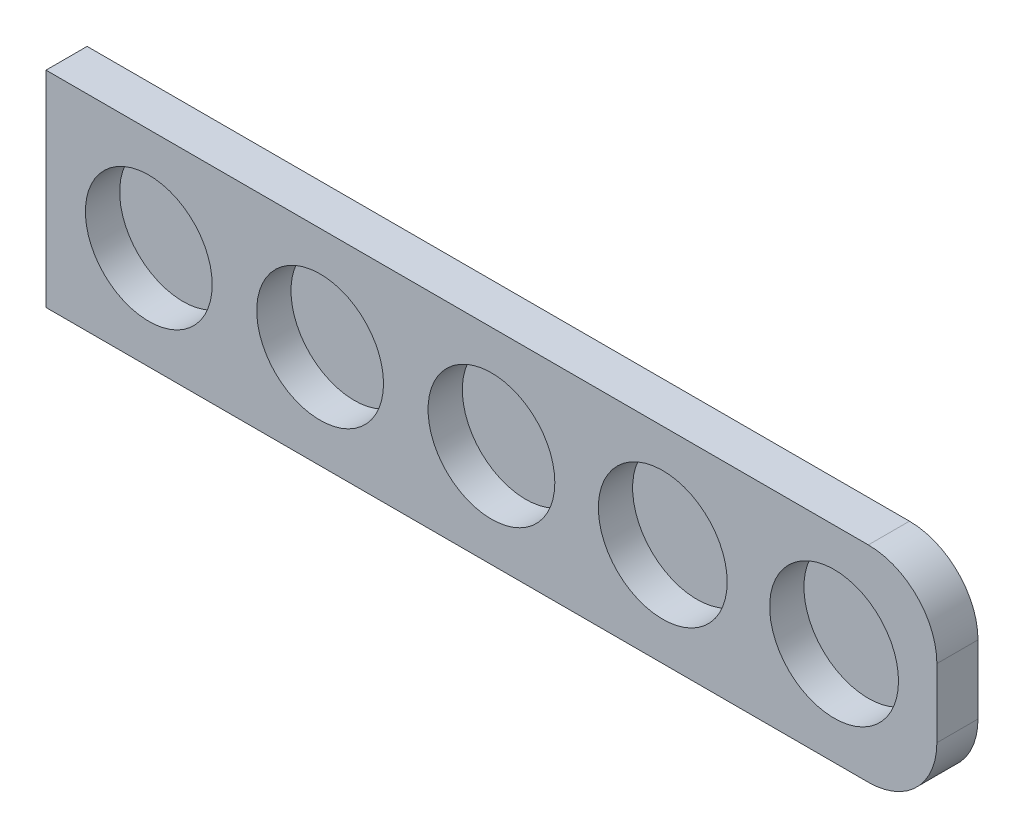
ISO-10303-21;
HEADER;
FILE_DESCRIPTION(('STEP AP214'),'2;1');
FILE_NAME('part.step','',(''),(''),'','','');
FILE_SCHEMA(('AUTOMOTIVE_DESIGN { 1 0 10303 214 1 1 1 1 }'));
ENDSEC;
DATA;
#1=APPLICATION_CONTEXT('core data for automotive mechanical design processes');
#2=APPLICATION_PROTOCOL_DEFINITION('international standard','automotive_design',2000,#1);
#3=PRODUCT_CONTEXT('',#1,'mechanical');
#4=PRODUCT('Part','Part','',(#3));
#5=PRODUCT_RELATED_PRODUCT_CATEGORY('part','',(#4));
#6=PRODUCT_DEFINITION_FORMATION('','',#4);
#7=PRODUCT_DEFINITION_CONTEXT('part definition',#1,'design');
#8=PRODUCT_DEFINITION('design','',#6,#7);
#9=PRODUCT_DEFINITION_SHAPE('','',#8);
#10=(LENGTH_UNIT() NAMED_UNIT(*) SI_UNIT(.MILLI.,.METRE.));
#11=(NAMED_UNIT(*) PLANE_ANGLE_UNIT() SI_UNIT($,.RADIAN.));
#12=(NAMED_UNIT(*) SI_UNIT($,.STERADIAN.) SOLID_ANGLE_UNIT());
#13=UNCERTAINTY_MEASURE_WITH_UNIT(LENGTH_MEASURE(1.E-05),#10,'distance_accuracy_value','');
#14=(GEOMETRIC_REPRESENTATION_CONTEXT(3) GLOBAL_UNCERTAINTY_ASSIGNED_CONTEXT((#13)) GLOBAL_UNIT_ASSIGNED_CONTEXT((#10,
#11,#12)) REPRESENTATION_CONTEXT('',''));
#15=CARTESIAN_POINT('',(0.,0.,0.));
#16=DIRECTION('',(0.,0.,1.));
#17=DIRECTION('',(1.,0.,0.));
#18=AXIS2_PLACEMENT_3D('',#15,#16,#17);
#19=CARTESIAN_POINT('',(0.,-56.,6.));
#20=DIRECTION('',(0.,1.,0.));
#21=DIRECTION('',(0.,0.,1.));
#22=AXIS2_PLACEMENT_3D('',#19,#20,#21);
#23=PLANE('',#22);
#24=DIRECTION('',(1.,0.,0.));
#25=VECTOR('',#24,1.);
#26=CARTESIAN_POINT('',(0.,-56.,6.));
#27=LINE('',#26,#25);
#28=CARTESIAN_POINT('',(0.,-56.,6.));
#29=VERTEX_POINT('',#28);
#30=CARTESIAN_POINT('',(120.,-56.,6.));
#31=VERTEX_POINT('',#30);
#32=EDGE_CURVE('E103',#29,#31,#27,.T.);
#33=ORIENTED_EDGE('',*,*,#32,.T.);
#34=DIRECTION('',(0.,0.,-1.));
#35=VECTOR('',#34,1.);
#36=CARTESIAN_POINT('',(120.,-56.,6.));
#37=LINE('',#36,#35);
#38=CARTESIAN_POINT('',(120.,-56.,0.));
#39=VERTEX_POINT('',#38);
#40=EDGE_CURVE('E117',#31,#39,#37,.T.);
#41=ORIENTED_EDGE('',*,*,#40,.T.);
#42=DIRECTION('',(1.,0.,0.));
#43=VECTOR('',#42,1.);
#44=CARTESIAN_POINT('',(0.,-56.,0.));
#45=LINE('',#44,#43);
#46=CARTESIAN_POINT('',(0.,-56.,0.));
#47=VERTEX_POINT('',#46);
#48=EDGE_CURVE('E107',#47,#39,#45,.T.);
#49=ORIENTED_EDGE('',*,*,#48,.F.);
#50=DIRECTION('',(0.,0.,-1.));
#51=VECTOR('',#50,1.);
#52=CARTESIAN_POINT('',(0.,-56.,6.));
#53=LINE('',#52,#51);
#54=EDGE_CURVE('E98',#29,#47,#53,.T.);
#55=ORIENTED_EDGE('',*,*,#54,.F.);
#56=EDGE_LOOP('',(#33,#41,#49,#55));
#57=FACE_BOUND('',#56,.T.);
#58=ADVANCED_FACE('F33',(#57),#23,.T.);
#59=CARTESIAN_POINT('',(0.,-86.,6.));
#60=DIRECTION('',(-1.,0.,0.));
#61=DIRECTION('',(0.,-1.,0.));
#62=AXIS2_PLACEMENT_3D('',#59,#60,#61);
#63=PLANE('',#62);
#64=DIRECTION('',(0.,1.,0.));
#65=VECTOR('',#64,1.);
#66=CARTESIAN_POINT('',(0.,-86.,0.));
#67=LINE('',#66,#65);
#68=CARTESIAN_POINT('',(0.,-86.,0.));
#69=VERTEX_POINT('',#68);
#70=EDGE_CURVE('E97',#69,#47,#67,.T.);
#71=ORIENTED_EDGE('',*,*,#70,.F.);
#72=DIRECTION('',(0.,0.,-1.));
#73=VECTOR('',#72,1.);
#74=CARTESIAN_POINT('',(0.,-86.,6.));
#75=LINE('',#74,#73);
#76=CARTESIAN_POINT('',(0.,-86.,6.));
#77=VERTEX_POINT('',#76);
#78=EDGE_CURVE('E87',#77,#69,#75,.T.);
#79=ORIENTED_EDGE('',*,*,#78,.F.);
#80=DIRECTION('',(0.,1.,0.));
#81=VECTOR('',#80,1.);
#82=CARTESIAN_POINT('',(0.,-86.,6.));
#83=LINE('',#82,#81);
#84=EDGE_CURVE('E90',#77,#29,#83,.T.);
#85=ORIENTED_EDGE('',*,*,#84,.T.);
#86=ORIENTED_EDGE('',*,*,#54,.T.);
#87=EDGE_LOOP('',(#71,#79,#85,#86));
#88=FACE_BOUND('',#87,.T.);
#89=ADVANCED_FACE('F95',(#88),#63,.T.);
#90=CARTESIAN_POINT('',(130.,-86.,6.));
#91=DIRECTION('',(0.,-1.,0.));
#92=DIRECTION('',(0.,0.,-1.));
#93=AXIS2_PLACEMENT_3D('',#90,#91,#92);
#94=PLANE('',#93);
#95=DIRECTION('',(-1.,0.,0.));
#96=VECTOR('',#95,1.);
#97=CARTESIAN_POINT('',(130.,-86.,0.));
#98=LINE('',#97,#96);
#99=CARTESIAN_POINT('',(120.,-86.,0.));
#100=VERTEX_POINT('',#99);
#101=EDGE_CURVE('E114',#100,#69,#98,.T.);
#102=ORIENTED_EDGE('',*,*,#101,.F.);
#103=DIRECTION('',(0.,0.,-1.));
#104=VECTOR('',#103,1.);
#105=CARTESIAN_POINT('',(120.,-86.,6.));
#106=LINE('',#105,#104);
#107=CARTESIAN_POINT('',(120.,-86.,6.));
#108=VERTEX_POINT('',#107);
#109=EDGE_CURVE('E11',#100,#108,#106,.F.);
#110=ORIENTED_EDGE('',*,*,#109,.T.);
#111=DIRECTION('',(-1.,0.,0.));
#112=VECTOR('',#111,1.);
#113=CARTESIAN_POINT('',(130.,-86.,6.));
#114=LINE('',#113,#112);
#115=EDGE_CURVE('E84',#108,#77,#114,.T.);
#116=ORIENTED_EDGE('',*,*,#115,.T.);
#117=ORIENTED_EDGE('',*,*,#78,.T.);
#118=EDGE_LOOP('',(#102,#110,#116,#117));
#119=FACE_BOUND('',#118,.T.);
#120=ADVANCED_FACE('F86',(#119),#94,.T.);
#121=CARTESIAN_POINT('',(130.,-56.,6.));
#122=DIRECTION('',(1.,0.,0.));
#123=DIRECTION('',(0.,0.,-1.));
#124=AXIS2_PLACEMENT_3D('',#121,#122,#123);
#125=PLANE('',#124);
#126=DIRECTION('',(0.,-1.,0.));
#127=VECTOR('',#126,1.);
#128=CARTESIAN_POINT('',(130.,-56.,0.));
#129=LINE('',#128,#127);
#130=CARTESIAN_POINT('',(130.,-66.,0.));
#131=VERTEX_POINT('',#130);
#132=CARTESIAN_POINT('',(130.,-76.,0.));
#133=VERTEX_POINT('',#132);
#134=EDGE_CURVE('E110',#131,#133,#129,.T.);
#135=ORIENTED_EDGE('',*,*,#134,.F.);
#136=DIRECTION('',(0.,0.,-1.));
#137=VECTOR('',#136,1.);
#138=CARTESIAN_POINT('',(130.,-66.,6.));
#139=LINE('',#138,#137);
#140=CARTESIAN_POINT('',(130.,-66.,6.));
#141=VERTEX_POINT('',#140);
#142=EDGE_CURVE('E128',#131,#141,#139,.F.);
#143=ORIENTED_EDGE('',*,*,#142,.T.);
#144=DIRECTION('',(0.,-1.,0.));
#145=VECTOR('',#144,1.);
#146=CARTESIAN_POINT('',(130.,-56.,6.));
#147=LINE('',#146,#145);
#148=CARTESIAN_POINT('',(130.,-76.,6.));
#149=VERTEX_POINT('',#148);
#150=EDGE_CURVE('E91',#141,#149,#147,.T.);
#151=ORIENTED_EDGE('',*,*,#150,.T.);
#152=DIRECTION('',(0.,0.,-1.));
#153=VECTOR('',#152,1.);
#154=CARTESIAN_POINT('',(130.,-76.,6.));
#155=LINE('',#154,#153);
#156=EDGE_CURVE('E125',#149,#133,#155,.T.);
#157=ORIENTED_EDGE('',*,*,#156,.T.);
#158=EDGE_LOOP('',(#135,#143,#151,#157));
#159=FACE_BOUND('',#158,.T.);
#160=ADVANCED_FACE('F142',(#159),#125,.T.);
#161=CARTESIAN_POINT('',(0.,0.,6.));
#162=DIRECTION('',(0.,0.,-1.));
#163=DIRECTION('',(-1.,0.,0.));
#164=AXIS2_PLACEMENT_3D('',#161,#162,#163);
#165=PLANE('',#164);
#166=CARTESIAN_POINT('',(15.,-71.,6.));
#167=DIRECTION('',(0.,0.,1.));
#168=DIRECTION('',(1.,0.,0.));
#169=AXIS2_PLACEMENT_3D('',#166,#167,#168);
#170=CIRCLE('',#169,9.24999999999999);
#171=CARTESIAN_POINT('',(24.25,-71.,6.));
#172=VERTEX_POINT('',#171);
#173=EDGE_CURVE('E212',#172,#172,#170,.T.);
#174=ORIENTED_EDGE('',*,*,#173,.F.);
#175=EDGE_LOOP('',(#174));
#176=FACE_BOUND('',#175,.T.);
#177=CARTESIAN_POINT('',(40.,-71.,6.));
#178=DIRECTION('',(0.,0.,1.));
#179=DIRECTION('',(1.,0.,0.));
#180=AXIS2_PLACEMENT_3D('',#177,#178,#179);
#181=CIRCLE('',#180,9.24999999999999);
#182=CARTESIAN_POINT('',(49.25,-71.,6.));
#183=VERTEX_POINT('',#182);
#184=EDGE_CURVE('E214',#183,#183,#181,.T.);
#185=ORIENTED_EDGE('',*,*,#184,.F.);
#186=EDGE_LOOP('',(#185));
#187=FACE_BOUND('',#186,.T.);
#188=CARTESIAN_POINT('',(65.,-71.,6.));
#189=DIRECTION('',(0.,0.,1.));
#190=DIRECTION('',(1.,0.,0.));
#191=AXIS2_PLACEMENT_3D('',#188,#189,#190);
#192=CIRCLE('',#191,9.24999999999999);
#193=CARTESIAN_POINT('',(74.25,-71.,6.));
#194=VERTEX_POINT('',#193);
#195=EDGE_CURVE('E222',#194,#194,#192,.T.);
#196=ORIENTED_EDGE('',*,*,#195,.F.);
#197=EDGE_LOOP('',(#196));
#198=FACE_BOUND('',#197,.T.);
#199=CARTESIAN_POINT('',(90.,-71.,6.));
#200=DIRECTION('',(0.,0.,1.));
#201=DIRECTION('',(1.,0.,0.));
#202=AXIS2_PLACEMENT_3D('',#199,#200,#201);
#203=CIRCLE('',#202,9.39999999999999);
#204=CARTESIAN_POINT('',(99.4,-71.,6.));
#205=VERTEX_POINT('',#204);
#206=EDGE_CURVE('E228',#205,#205,#203,.T.);
#207=ORIENTED_EDGE('',*,*,#206,.F.);
#208=EDGE_LOOP('',(#207));
#209=FACE_BOUND('',#208,.T.);
#210=CARTESIAN_POINT('',(115.,-71.,6.));
#211=DIRECTION('',(0.,0.,1.));
#212=DIRECTION('',(1.,0.,0.));
#213=AXIS2_PLACEMENT_3D('',#210,#211,#212);
#214=CIRCLE('',#213,9.39999999999999);
#215=CARTESIAN_POINT('',(124.4,-71.,6.));
#216=VERTEX_POINT('',#215);
#217=EDGE_CURVE('E234',#216,#216,#214,.T.);
#218=ORIENTED_EDGE('',*,*,#217,.F.);
#219=EDGE_LOOP('',(#218));
#220=FACE_BOUND('',#219,.T.);
#221=ORIENTED_EDGE('',*,*,#150,.F.);
#222=CARTESIAN_POINT('',(120.,-66.,6.));
#223=DIRECTION('',(0.,0.,-1.));
#224=DIRECTION('',(-1.,0.,0.));
#225=AXIS2_PLACEMENT_3D('',#222,#223,#224);
#226=CIRCLE('',#225,10.);
#227=EDGE_CURVE('E41',#141,#31,#226,.F.);
#228=ORIENTED_EDGE('',*,*,#227,.T.);
#229=ORIENTED_EDGE('',*,*,#32,.F.);
#230=ORIENTED_EDGE('',*,*,#84,.F.);
#231=ORIENTED_EDGE('',*,*,#115,.F.);
#232=CARTESIAN_POINT('',(120.,-76.,6.));
#233=DIRECTION('',(0.,0.,-1.));
#234=DIRECTION('',(-1.,0.,0.));
#235=AXIS2_PLACEMENT_3D('',#232,#233,#234);
#236=CIRCLE('',#235,10.);
#237=EDGE_CURVE('E53',#108,#149,#236,.F.);
#238=ORIENTED_EDGE('',*,*,#237,.T.);
#239=EDGE_LOOP('',(#221,#228,#229,#230,#231,#238));
#240=FACE_BOUND('',#239,.T.);
#241=ADVANCED_FACE('F101',(#176,#187,#198,#209,#220,#240),#165,.F.);
#242=CARTESIAN_POINT('',(0.,0.,0.));
#243=DIRECTION('',(0.,0.,-1.));
#244=DIRECTION('',(-1.,0.,0.));
#245=AXIS2_PLACEMENT_3D('',#242,#243,#244);
#246=PLANE('',#245);
#247=ORIENTED_EDGE('',*,*,#48,.T.);
#248=CARTESIAN_POINT('',(120.,-66.,0.));
#249=DIRECTION('',(0.,0.,-1.));
#250=DIRECTION('',(-1.,0.,0.));
#251=AXIS2_PLACEMENT_3D('',#248,#249,#250);
#252=CIRCLE('',#251,10.);
#253=EDGE_CURVE('E123',#39,#131,#252,.T.);
#254=ORIENTED_EDGE('',*,*,#253,.T.);
#255=ORIENTED_EDGE('',*,*,#134,.T.);
#256=CARTESIAN_POINT('',(120.,-76.,0.));
#257=DIRECTION('',(0.,0.,-1.));
#258=DIRECTION('',(-1.,0.,0.));
#259=AXIS2_PLACEMENT_3D('',#256,#257,#258);
#260=CIRCLE('',#259,10.);
#261=EDGE_CURVE('E121',#133,#100,#260,.T.);
#262=ORIENTED_EDGE('',*,*,#261,.T.);
#263=ORIENTED_EDGE('',*,*,#101,.T.);
#264=ORIENTED_EDGE('',*,*,#70,.T.);
#265=EDGE_LOOP('',(#247,#254,#255,#262,#263,#264));
#266=FACE_BOUND('',#265,.T.);
#267=ADVANCED_FACE('F140',(#266),#246,.T.);
#268=CARTESIAN_POINT('',(115.,-71.,1.00000000000001));
#269=DIRECTION('',(0.,0.,-1.));
#270=DIRECTION('',(-1.,0.,0.));
#271=AXIS2_PLACEMENT_3D('',#268,#269,#270);
#272=PLANE('',#271);
#273=CARTESIAN_POINT('',(115.,-71.,0.999999999999995));
#274=DIRECTION('',(0.,0.,1.));
#275=DIRECTION('',(1.,0.,0.));
#276=AXIS2_PLACEMENT_3D('',#273,#274,#275);
#277=CIRCLE('',#276,9.39999999999999);
#278=CARTESIAN_POINT('',(124.4,-71.,0.999999999999995));
#279=VERTEX_POINT('',#278);
#280=EDGE_CURVE('E111',#279,#279,#277,.T.);
#281=ORIENTED_EDGE('',*,*,#280,.T.);
#282=EDGE_LOOP('',(#281));
#283=FACE_BOUND('',#282,.T.);
#284=ADVANCED_FACE('F163',(#283),#272,.F.);
#285=CARTESIAN_POINT('',(115.,-71.,6.));
#286=DIRECTION('',(0.,0.,1.));
#287=DIRECTION('',(1.,0.,0.));
#288=AXIS2_PLACEMENT_3D('',#285,#286,#287);
#289=CYLINDRICAL_SURFACE('',#288,9.39999999999999);
#290=ORIENTED_EDGE('',*,*,#280,.F.);
#291=EDGE_LOOP('',(#290));
#292=FACE_BOUND('',#291,.T.);
#293=ORIENTED_EDGE('',*,*,#217,.T.);
#294=EDGE_LOOP('',(#293));
#295=FACE_BOUND('',#294,.T.);
#296=ADVANCED_FACE('F169',(#292,#295),#289,.F.);
#297=CARTESIAN_POINT('',(90.,-71.,1.00000000000001));
#298=DIRECTION('',(0.,0.,-1.));
#299=DIRECTION('',(-1.,0.,0.));
#300=AXIS2_PLACEMENT_3D('',#297,#298,#299);
#301=PLANE('',#300);
#302=CARTESIAN_POINT('',(90.,-71.,0.999999999999995));
#303=DIRECTION('',(0.,0.,1.));
#304=DIRECTION('',(1.,0.,0.));
#305=AXIS2_PLACEMENT_3D('',#302,#303,#304);
#306=CIRCLE('',#305,9.39999999999999);
#307=CARTESIAN_POINT('',(99.4,-71.,0.999999999999995));
#308=VERTEX_POINT('',#307);
#309=EDGE_CURVE('E231',#308,#308,#306,.T.);
#310=ORIENTED_EDGE('',*,*,#309,.T.);
#311=EDGE_LOOP('',(#310));
#312=FACE_BOUND('',#311,.T.);
#313=ADVANCED_FACE('F173',(#312),#301,.F.);
#314=CARTESIAN_POINT('',(90.,-71.,6.));
#315=DIRECTION('',(0.,0.,1.));
#316=DIRECTION('',(1.,0.,0.));
#317=AXIS2_PLACEMENT_3D('',#314,#315,#316);
#318=CYLINDRICAL_SURFACE('',#317,9.39999999999999);
#319=ORIENTED_EDGE('',*,*,#309,.F.);
#320=EDGE_LOOP('',(#319));
#321=FACE_BOUND('',#320,.T.);
#322=ORIENTED_EDGE('',*,*,#206,.T.);
#323=EDGE_LOOP('',(#322));
#324=FACE_BOUND('',#323,.T.);
#325=ADVANCED_FACE('F177',(#321,#324),#318,.F.);
#326=CARTESIAN_POINT('',(65.,-71.,1.00000000000001));
#327=DIRECTION('',(0.,0.,-1.));
#328=DIRECTION('',(-1.,0.,0.));
#329=AXIS2_PLACEMENT_3D('',#326,#327,#328);
#330=PLANE('',#329);
#331=CARTESIAN_POINT('',(65.,-71.,0.999999999999995));
#332=DIRECTION('',(0.,0.,1.));
#333=DIRECTION('',(1.,0.,0.));
#334=AXIS2_PLACEMENT_3D('',#331,#332,#333);
#335=CIRCLE('',#334,9.24999999999998);
#336=CARTESIAN_POINT('',(74.25,-71.,0.999999999999995));
#337=VERTEX_POINT('',#336);
#338=EDGE_CURVE('E225',#337,#337,#335,.T.);
#339=ORIENTED_EDGE('',*,*,#338,.T.);
#340=EDGE_LOOP('',(#339));
#341=FACE_BOUND('',#340,.T.);
#342=ADVANCED_FACE('F181',(#341),#330,.F.);
#343=CARTESIAN_POINT('',(65.,-71.,6.));
#344=DIRECTION('',(0.,0.,1.));
#345=DIRECTION('',(1.,0.,0.));
#346=AXIS2_PLACEMENT_3D('',#343,#344,#345);
#347=CYLINDRICAL_SURFACE('',#346,9.24999999999999);
#348=ORIENTED_EDGE('',*,*,#338,.F.);
#349=EDGE_LOOP('',(#348));
#350=FACE_BOUND('',#349,.T.);
#351=ORIENTED_EDGE('',*,*,#195,.T.);
#352=EDGE_LOOP('',(#351));
#353=FACE_BOUND('',#352,.T.);
#354=ADVANCED_FACE('F185',(#350,#353),#347,.F.);
#355=CARTESIAN_POINT('',(40.,-71.,1.00000000000001));
#356=DIRECTION('',(0.,0.,-1.));
#357=DIRECTION('',(-1.,0.,0.));
#358=AXIS2_PLACEMENT_3D('',#355,#356,#357);
#359=PLANE('',#358);
#360=CARTESIAN_POINT('',(40.,-71.,0.999999999999995));
#361=DIRECTION('',(0.,0.,1.));
#362=DIRECTION('',(1.,0.,0.));
#363=AXIS2_PLACEMENT_3D('',#360,#361,#362);
#364=CIRCLE('',#363,9.24999999999999);
#365=CARTESIAN_POINT('',(49.25,-71.,0.999999999999995));
#366=VERTEX_POINT('',#365);
#367=EDGE_CURVE('E219',#366,#366,#364,.T.);
#368=ORIENTED_EDGE('',*,*,#367,.T.);
#369=EDGE_LOOP('',(#368));
#370=FACE_BOUND('',#369,.T.);
#371=ADVANCED_FACE('F189',(#370),#359,.F.);
#372=CARTESIAN_POINT('',(40.,-71.,6.));
#373=DIRECTION('',(0.,0.,1.));
#374=DIRECTION('',(1.,0.,0.));
#375=AXIS2_PLACEMENT_3D('',#372,#373,#374);
#376=CYLINDRICAL_SURFACE('',#375,9.24999999999999);
#377=ORIENTED_EDGE('',*,*,#367,.F.);
#378=EDGE_LOOP('',(#377));
#379=FACE_BOUND('',#378,.T.);
#380=ORIENTED_EDGE('',*,*,#184,.T.);
#381=EDGE_LOOP('',(#380));
#382=FACE_BOUND('',#381,.T.);
#383=ADVANCED_FACE('F193',(#379,#382),#376,.F.);
#384=CARTESIAN_POINT('',(15.,-71.,1.00000000000001));
#385=DIRECTION('',(0.,0.,-1.));
#386=DIRECTION('',(-1.,0.,0.));
#387=AXIS2_PLACEMENT_3D('',#384,#385,#386);
#388=PLANE('',#387);
#389=CARTESIAN_POINT('',(15.,-71.,0.999999999999995));
#390=DIRECTION('',(0.,0.,1.));
#391=DIRECTION('',(1.,0.,0.));
#392=AXIS2_PLACEMENT_3D('',#389,#390,#391);
#393=CIRCLE('',#392,9.24999999999999);
#394=CARTESIAN_POINT('',(24.25,-71.,0.999999999999995));
#395=VERTEX_POINT('',#394);
#396=EDGE_CURVE('E209',#395,#395,#393,.T.);
#397=ORIENTED_EDGE('',*,*,#396,.T.);
#398=EDGE_LOOP('',(#397));
#399=FACE_BOUND('',#398,.T.);
#400=ADVANCED_FACE('F197',(#399),#388,.F.);
#401=CARTESIAN_POINT('',(15.,-71.,6.));
#402=DIRECTION('',(0.,0.,1.));
#403=DIRECTION('',(1.,0.,0.));
#404=AXIS2_PLACEMENT_3D('',#401,#402,#403);
#405=CYLINDRICAL_SURFACE('',#404,9.24999999999999);
#406=ORIENTED_EDGE('',*,*,#396,.F.);
#407=EDGE_LOOP('',(#406));
#408=FACE_BOUND('',#407,.T.);
#409=ORIENTED_EDGE('',*,*,#173,.T.);
#410=EDGE_LOOP('',(#409));
#411=FACE_BOUND('',#410,.T.);
#412=ADVANCED_FACE('F149',(#408,#411),#405,.F.);
#413=CARTESIAN_POINT('',(120.,-66.,6.));
#414=DIRECTION('',(0.,0.,-1.));
#415=DIRECTION('',(-1.,0.,0.));
#416=AXIS2_PLACEMENT_3D('',#413,#414,#415);
#417=CYLINDRICAL_SURFACE('',#416,10.);
#418=ORIENTED_EDGE('',*,*,#227,.F.);
#419=ORIENTED_EDGE('',*,*,#142,.F.);
#420=ORIENTED_EDGE('',*,*,#253,.F.);
#421=ORIENTED_EDGE('',*,*,#40,.F.);
#422=EDGE_LOOP('',(#418,#419,#420,#421));
#423=FACE_BOUND('',#422,.T.);
#424=ADVANCED_FACE('F137',(#423),#417,.T.);
#425=CARTESIAN_POINT('',(120.,-76.,6.));
#426=DIRECTION('',(0.,0.,-1.));
#427=DIRECTION('',(-1.,0.,0.));
#428=AXIS2_PLACEMENT_3D('',#425,#426,#427);
#429=CYLINDRICAL_SURFACE('',#428,10.);
#430=ORIENTED_EDGE('',*,*,#237,.F.);
#431=ORIENTED_EDGE('',*,*,#109,.F.);
#432=ORIENTED_EDGE('',*,*,#261,.F.);
#433=ORIENTED_EDGE('',*,*,#156,.F.);
#434=EDGE_LOOP('',(#430,#431,#432,#433));
#435=FACE_BOUND('',#434,.T.);
#436=ADVANCED_FACE('F35',(#435),#429,.T.);
#437=CLOSED_SHELL('',(#58,#89,#120,#160,#241,#267,#284,#296,#313,#325,#342,#354,#371,#383,#400,
#412,#424,#436));
#438=MANIFOLD_SOLID_BREP('B2',#437);
#439=ADVANCED_BREP_SHAPE_REPRESENTATION('',(#18,#438),#14);
#440=SHAPE_DEFINITION_REPRESENTATION(#9,#439);
ENDSEC;
END-ISO-10303-21;
